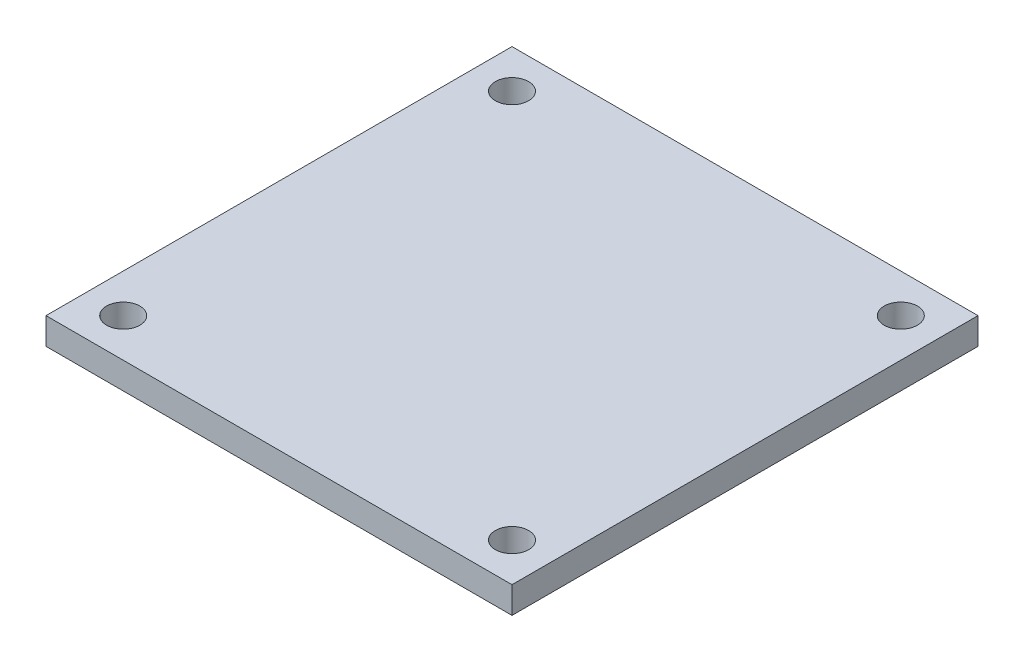
ISO-10303-21;
HEADER;
FILE_DESCRIPTION(('STEP AP214'),'2;1');
FILE_NAME('part.step','',(''),(''),'','','');
FILE_SCHEMA(('AUTOMOTIVE_DESIGN { 1 0 10303 214 1 1 1 1 }'));
ENDSEC;
DATA;
#1=APPLICATION_CONTEXT('core data for automotive mechanical design processes');
#2=APPLICATION_PROTOCOL_DEFINITION('international standard','automotive_design',2000,#1);
#3=PRODUCT_CONTEXT('',#1,'mechanical');
#4=PRODUCT('Part','Part','',(#3));
#5=PRODUCT_RELATED_PRODUCT_CATEGORY('part','',(#4));
#6=PRODUCT_DEFINITION_FORMATION('','',#4);
#7=PRODUCT_DEFINITION_CONTEXT('part definition',#1,'design');
#8=PRODUCT_DEFINITION('design','',#6,#7);
#9=PRODUCT_DEFINITION_SHAPE('','',#8);
#10=(LENGTH_UNIT() NAMED_UNIT(*) SI_UNIT(.MILLI.,.METRE.));
#11=(NAMED_UNIT(*) PLANE_ANGLE_UNIT() SI_UNIT($,.RADIAN.));
#12=(NAMED_UNIT(*) SI_UNIT($,.STERADIAN.) SOLID_ANGLE_UNIT());
#13=UNCERTAINTY_MEASURE_WITH_UNIT(LENGTH_MEASURE(1.E-05),#10,'distance_accuracy_value','');
#14=(GEOMETRIC_REPRESENTATION_CONTEXT(3) GLOBAL_UNCERTAINTY_ASSIGNED_CONTEXT((#13)) GLOBAL_UNIT_ASSIGNED_CONTEXT((#10,
#11,#12)) REPRESENTATION_CONTEXT('',''));
#15=CARTESIAN_POINT('',(0.,0.,0.));
#16=DIRECTION('',(0.,0.,1.));
#17=DIRECTION('',(1.,0.,0.));
#18=AXIS2_PLACEMENT_3D('',#15,#16,#17);
#19=CARTESIAN_POINT('',(-17.5,2.,-17.5));
#20=DIRECTION('',(1.,0.,0.));
#21=DIRECTION('',(0.,0.,-1.));
#22=AXIS2_PLACEMENT_3D('',#19,#20,#21);
#23=PLANE('',#22);
#24=DIRECTION('',(0.,0.,1.));
#25=VECTOR('',#24,1.);
#26=CARTESIAN_POINT('',(-17.5,0.,-17.5));
#27=LINE('',#26,#25);
#28=CARTESIAN_POINT('',(-17.5,0.,-17.5));
#29=VERTEX_POINT('',#28);
#30=CARTESIAN_POINT('',(-17.5,0.,17.5));
#31=VERTEX_POINT('',#30);
#32=EDGE_CURVE('E101',#29,#31,#27,.T.);
#33=ORIENTED_EDGE('',*,*,#32,.T.);
#34=DIRECTION('',(0.,-1.,0.));
#35=VECTOR('',#34,1.);
#36=CARTESIAN_POINT('',(-17.5,2.,17.5));
#37=LINE('',#36,#35);
#38=CARTESIAN_POINT('',(-17.5,2.,17.5));
#39=VERTEX_POINT('',#38);
#40=EDGE_CURVE('E11',#39,#31,#37,.T.);
#41=ORIENTED_EDGE('',*,*,#40,.F.);
#42=DIRECTION('',(0.,0.,1.));
#43=VECTOR('',#42,1.);
#44=CARTESIAN_POINT('',(-17.5,2.,-17.5));
#45=LINE('',#44,#43);
#46=CARTESIAN_POINT('',(-17.5,2.,-17.5));
#47=VERTEX_POINT('',#46);
#48=EDGE_CURVE('E89',#47,#39,#45,.T.);
#49=ORIENTED_EDGE('',*,*,#48,.F.);
#50=DIRECTION('',(0.,-1.,0.));
#51=VECTOR('',#50,1.);
#52=CARTESIAN_POINT('',(-17.5,2.,-17.5));
#53=LINE('',#52,#51);
#54=EDGE_CURVE('E97',#47,#29,#53,.T.);
#55=ORIENTED_EDGE('',*,*,#54,.T.);
#56=EDGE_LOOP('',(#33,#41,#49,#55));
#57=FACE_BOUND('',#56,.T.);
#58=ADVANCED_FACE('F38',(#57),#23,.F.);
#59=CARTESIAN_POINT('',(17.5,2.,17.5));
#60=DIRECTION('',(0.,0.,-1.));
#61=DIRECTION('',(-1.,0.,0.));
#62=AXIS2_PLACEMENT_3D('',#59,#60,#61);
#63=PLANE('',#62);
#64=DIRECTION('',(1.,0.,0.));
#65=VECTOR('',#64,1.);
#66=CARTESIAN_POINT('',(17.5,0.,17.5));
#67=LINE('',#66,#65);
#68=CARTESIAN_POINT('',(17.5,0.,17.5));
#69=VERTEX_POINT('',#68);
#70=EDGE_CURVE('E93',#31,#69,#67,.T.);
#71=ORIENTED_EDGE('',*,*,#70,.T.);
#72=DIRECTION('',(0.,-1.,0.));
#73=VECTOR('',#72,1.);
#74=CARTESIAN_POINT('',(17.5,2.,17.5));
#75=LINE('',#74,#73);
#76=CARTESIAN_POINT('',(17.5,2.,17.5));
#77=VERTEX_POINT('',#76);
#78=EDGE_CURVE('E46',#77,#69,#75,.T.);
#79=ORIENTED_EDGE('',*,*,#78,.F.);
#80=DIRECTION('',(1.,0.,0.));
#81=VECTOR('',#80,1.);
#82=CARTESIAN_POINT('',(17.5,2.,17.5));
#83=LINE('',#82,#81);
#84=EDGE_CURVE('E84',#39,#77,#83,.T.);
#85=ORIENTED_EDGE('',*,*,#84,.F.);
#86=ORIENTED_EDGE('',*,*,#40,.T.);
#87=EDGE_LOOP('',(#71,#79,#85,#86));
#88=FACE_BOUND('',#87,.T.);
#89=ADVANCED_FACE('F92',(#88),#63,.F.);
#90=CARTESIAN_POINT('',(17.5,2.,-17.5));
#91=DIRECTION('',(-1.,0.,0.));
#92=DIRECTION('',(0.,0.,1.));
#93=AXIS2_PLACEMENT_3D('',#90,#91,#92);
#94=PLANE('',#93);
#95=DIRECTION('',(0.,0.,-1.));
#96=VECTOR('',#95,1.);
#97=CARTESIAN_POINT('',(17.5,0.,-17.5));
#98=LINE('',#97,#96);
#99=CARTESIAN_POINT('',(17.5,0.,-17.5));
#100=VERTEX_POINT('',#99);
#101=EDGE_CURVE('E71',#69,#100,#98,.T.);
#102=ORIENTED_EDGE('',*,*,#101,.T.);
#103=DIRECTION('',(0.,-1.,0.));
#104=VECTOR('',#103,1.);
#105=CARTESIAN_POINT('',(17.5,2.,-17.5));
#106=LINE('',#105,#104);
#107=CARTESIAN_POINT('',(17.5,2.,-17.5));
#108=VERTEX_POINT('',#107);
#109=EDGE_CURVE('E94',#108,#100,#106,.T.);
#110=ORIENTED_EDGE('',*,*,#109,.F.);
#111=DIRECTION('',(0.,0.,-1.));
#112=VECTOR('',#111,1.);
#113=CARTESIAN_POINT('',(17.5,2.,-17.5));
#114=LINE('',#113,#112);
#115=EDGE_CURVE('E87',#77,#108,#114,.T.);
#116=ORIENTED_EDGE('',*,*,#115,.F.);
#117=ORIENTED_EDGE('',*,*,#78,.T.);
#118=EDGE_LOOP('',(#102,#110,#116,#117));
#119=FACE_BOUND('',#118,.T.);
#120=ADVANCED_FACE('F95',(#119),#94,.F.);
#121=CARTESIAN_POINT('',(17.5,2.,-17.5));
#122=DIRECTION('',(0.,0.,1.));
#123=DIRECTION('',(1.,0.,0.));
#124=AXIS2_PLACEMENT_3D('',#121,#122,#123);
#125=PLANE('',#124);
#126=DIRECTION('',(-1.,0.,0.));
#127=VECTOR('',#126,1.);
#128=CARTESIAN_POINT('',(17.5,0.,-17.5));
#129=LINE('',#128,#127);
#130=EDGE_CURVE('E77',#100,#29,#129,.T.);
#131=ORIENTED_EDGE('',*,*,#130,.T.);
#132=ORIENTED_EDGE('',*,*,#54,.F.);
#133=DIRECTION('',(-1.,0.,0.));
#134=VECTOR('',#133,1.);
#135=CARTESIAN_POINT('',(17.5,2.,-17.5));
#136=LINE('',#135,#134);
#137=EDGE_CURVE('E54',#108,#47,#136,.T.);
#138=ORIENTED_EDGE('',*,*,#137,.F.);
#139=ORIENTED_EDGE('',*,*,#109,.T.);
#140=EDGE_LOOP('',(#131,#132,#138,#139));
#141=FACE_BOUND('',#140,.T.);
#142=ADVANCED_FACE('F109',(#141),#125,.F.);
#143=CARTESIAN_POINT('',(0.,2.,0.));
#144=DIRECTION('',(0.,-1.,0.));
#145=DIRECTION('',(0.,0.,-1.));
#146=AXIS2_PLACEMENT_3D('',#143,#144,#145);
#147=PLANE('',#146);
#148=CARTESIAN_POINT('',(14.6,2.,-14.6));
#149=DIRECTION('',(0.,1.,0.));
#150=DIRECTION('',(0.,0.,1.));
#151=AXIS2_PLACEMENT_3D('',#148,#149,#150);
#152=CIRCLE('',#151,1.25);
#153=CARTESIAN_POINT('',(14.6,2.,-13.35));
#154=VERTEX_POINT('',#153);
#155=EDGE_CURVE('E130',#154,#154,#152,.T.);
#156=ORIENTED_EDGE('',*,*,#155,.F.);
#157=EDGE_LOOP('',(#156));
#158=FACE_BOUND('',#157,.T.);
#159=CARTESIAN_POINT('',(-14.6,2.,-14.6));
#160=DIRECTION('',(0.,-1.,0.));
#161=DIRECTION('',(0.,0.,-1.));
#162=AXIS2_PLACEMENT_3D('',#159,#160,#161);
#163=CIRCLE('',#162,1.24999999999999);
#164=CARTESIAN_POINT('',(-14.6,2.,-15.85));
#165=VERTEX_POINT('',#164);
#166=EDGE_CURVE('E124',#165,#165,#163,.T.);
#167=ORIENTED_EDGE('',*,*,#166,.T.);
#168=EDGE_LOOP('',(#167));
#169=FACE_BOUND('',#168,.T.);
#170=CARTESIAN_POINT('',(-14.6,2.,14.6));
#171=DIRECTION('',(0.,1.,0.));
#172=DIRECTION('',(0.,0.,1.));
#173=AXIS2_PLACEMENT_3D('',#170,#171,#172);
#174=CIRCLE('',#173,1.25);
#175=CARTESIAN_POINT('',(-14.6,2.,15.85));
#176=VERTEX_POINT('',#175);
#177=EDGE_CURVE('E118',#176,#176,#174,.T.);
#178=ORIENTED_EDGE('',*,*,#177,.F.);
#179=EDGE_LOOP('',(#178));
#180=FACE_BOUND('',#179,.T.);
#181=CARTESIAN_POINT('',(14.6,2.,14.6));
#182=DIRECTION('',(0.,1.,0.));
#183=DIRECTION('',(0.,0.,1.));
#184=AXIS2_PLACEMENT_3D('',#181,#182,#183);
#185=CIRCLE('',#184,1.25);
#186=CARTESIAN_POINT('',(14.6,2.,15.85));
#187=VERTEX_POINT('',#186);
#188=EDGE_CURVE('E115',#187,#187,#185,.F.);
#189=ORIENTED_EDGE('',*,*,#188,.T.);
#190=EDGE_LOOP('',(#189));
#191=FACE_BOUND('',#190,.T.);
#192=ORIENTED_EDGE('',*,*,#48,.T.);
#193=ORIENTED_EDGE('',*,*,#84,.T.);
#194=ORIENTED_EDGE('',*,*,#115,.T.);
#195=ORIENTED_EDGE('',*,*,#137,.T.);
#196=EDGE_LOOP('',(#192,#193,#194,#195));
#197=FACE_BOUND('',#196,.T.);
#198=ADVANCED_FACE('F85',(#158,#169,#180,#191,#197),#147,.F.);
#199=CARTESIAN_POINT('',(0.,0.,0.));
#200=DIRECTION('',(0.,-1.,0.));
#201=DIRECTION('',(0.,0.,-1.));
#202=AXIS2_PLACEMENT_3D('',#199,#200,#201);
#203=PLANE('',#202);
#204=CARTESIAN_POINT('',(14.6,0.,-14.6));
#205=DIRECTION('',(0.,1.,0.));
#206=DIRECTION('',(0.,0.,1.));
#207=AXIS2_PLACEMENT_3D('',#204,#205,#206);
#208=CIRCLE('',#207,1.25);
#209=CARTESIAN_POINT('',(14.6,0.,-13.35));
#210=VERTEX_POINT('',#209);
#211=EDGE_CURVE('E133',#210,#210,#208,.T.);
#212=ORIENTED_EDGE('',*,*,#211,.T.);
#213=EDGE_LOOP('',(#212));
#214=FACE_BOUND('',#213,.T.);
#215=CARTESIAN_POINT('',(-14.6,0.,-14.6));
#216=DIRECTION('',(0.,-1.,0.));
#217=DIRECTION('',(0.,0.,-1.));
#218=AXIS2_PLACEMENT_3D('',#215,#216,#217);
#219=CIRCLE('',#218,1.24999999999999);
#220=CARTESIAN_POINT('',(-14.6,0.,-15.85));
#221=VERTEX_POINT('',#220);
#222=EDGE_CURVE('E127',#221,#221,#219,.T.);
#223=ORIENTED_EDGE('',*,*,#222,.F.);
#224=EDGE_LOOP('',(#223));
#225=FACE_BOUND('',#224,.T.);
#226=CARTESIAN_POINT('',(-14.6,0.,14.6));
#227=DIRECTION('',(0.,1.,0.));
#228=DIRECTION('',(0.,0.,1.));
#229=AXIS2_PLACEMENT_3D('',#226,#227,#228);
#230=CIRCLE('',#229,1.25);
#231=CARTESIAN_POINT('',(-14.6,0.,15.85));
#232=VERTEX_POINT('',#231);
#233=EDGE_CURVE('E121',#232,#232,#230,.T.);
#234=ORIENTED_EDGE('',*,*,#233,.T.);
#235=EDGE_LOOP('',(#234));
#236=FACE_BOUND('',#235,.T.);
#237=CARTESIAN_POINT('',(14.6,0.,14.6));
#238=DIRECTION('',(0.,1.,0.));
#239=DIRECTION('',(0.,0.,1.));
#240=AXIS2_PLACEMENT_3D('',#237,#238,#239);
#241=CIRCLE('',#240,1.25);
#242=CARTESIAN_POINT('',(14.6,0.,15.85));
#243=VERTEX_POINT('',#242);
#244=EDGE_CURVE('E104',#243,#243,#241,.F.);
#245=ORIENTED_EDGE('',*,*,#244,.F.);
#246=EDGE_LOOP('',(#245));
#247=FACE_BOUND('',#246,.T.);
#248=ORIENTED_EDGE('',*,*,#32,.F.);
#249=ORIENTED_EDGE('',*,*,#130,.F.);
#250=ORIENTED_EDGE('',*,*,#101,.F.);
#251=ORIENTED_EDGE('',*,*,#70,.F.);
#252=EDGE_LOOP('',(#248,#249,#250,#251));
#253=FACE_BOUND('',#252,.T.);
#254=ADVANCED_FACE('F112',(#214,#225,#236,#247,#253),#203,.T.);
#255=CARTESIAN_POINT('',(14.6,0.,14.6));
#256=DIRECTION('',(0.,1.,0.));
#257=DIRECTION('',(0.,0.,1.));
#258=AXIS2_PLACEMENT_3D('',#255,#256,#257);
#259=CYLINDRICAL_SURFACE('',#258,1.25);
#260=ORIENTED_EDGE('',*,*,#244,.T.);
#261=EDGE_LOOP('',(#260));
#262=FACE_BOUND('',#261,.T.);
#263=ORIENTED_EDGE('',*,*,#188,.F.);
#264=EDGE_LOOP('',(#263));
#265=FACE_BOUND('',#264,.T.);
#266=ADVANCED_FACE('F150',(#262,#265),#259,.F.);
#267=CARTESIAN_POINT('',(-14.6,0.,14.6));
#268=DIRECTION('',(0.,1.,0.));
#269=DIRECTION('',(0.,0.,1.));
#270=AXIS2_PLACEMENT_3D('',#267,#268,#269);
#271=CYLINDRICAL_SURFACE('',#270,1.25);
#272=ORIENTED_EDGE('',*,*,#233,.F.);
#273=EDGE_LOOP('',(#272));
#274=FACE_BOUND('',#273,.T.);
#275=ORIENTED_EDGE('',*,*,#177,.T.);
#276=EDGE_LOOP('',(#275));
#277=FACE_BOUND('',#276,.T.);
#278=ADVANCED_FACE('F152',(#274,#277),#271,.F.);
#279=CARTESIAN_POINT('',(-14.6,0.,-14.6));
#280=DIRECTION('',(0.,1.,0.));
#281=DIRECTION('',(0.,0.,1.));
#282=AXIS2_PLACEMENT_3D('',#279,#280,#281);
#283=CYLINDRICAL_SURFACE('',#282,1.24999999999999);
#284=ORIENTED_EDGE('',*,*,#222,.T.);
#285=EDGE_LOOP('',(#284));
#286=FACE_BOUND('',#285,.T.);
#287=ORIENTED_EDGE('',*,*,#166,.F.);
#288=EDGE_LOOP('',(#287));
#289=FACE_BOUND('',#288,.T.);
#290=ADVANCED_FACE('F159',(#286,#289),#283,.F.);
#291=CARTESIAN_POINT('',(14.6,0.,-14.6));
#292=DIRECTION('',(0.,1.,0.));
#293=DIRECTION('',(0.,0.,1.));
#294=AXIS2_PLACEMENT_3D('',#291,#292,#293);
#295=CYLINDRICAL_SURFACE('',#294,1.25);
#296=ORIENTED_EDGE('',*,*,#211,.F.);
#297=EDGE_LOOP('',(#296));
#298=FACE_BOUND('',#297,.T.);
#299=ORIENTED_EDGE('',*,*,#155,.T.);
#300=EDGE_LOOP('',(#299));
#301=FACE_BOUND('',#300,.T.);
#302=ADVANCED_FACE('F139',(#298,#301),#295,.F.);
#303=CLOSED_SHELL('',(#58,#89,#120,#142,#198,#254,#266,#278,#290,#302));
#304=MANIFOLD_SOLID_BREP('B2',#303);
#305=ADVANCED_BREP_SHAPE_REPRESENTATION('',(#18,#304),#14);
#306=SHAPE_DEFINITION_REPRESENTATION(#9,#305);
ENDSEC;
END-ISO-10303-21;
